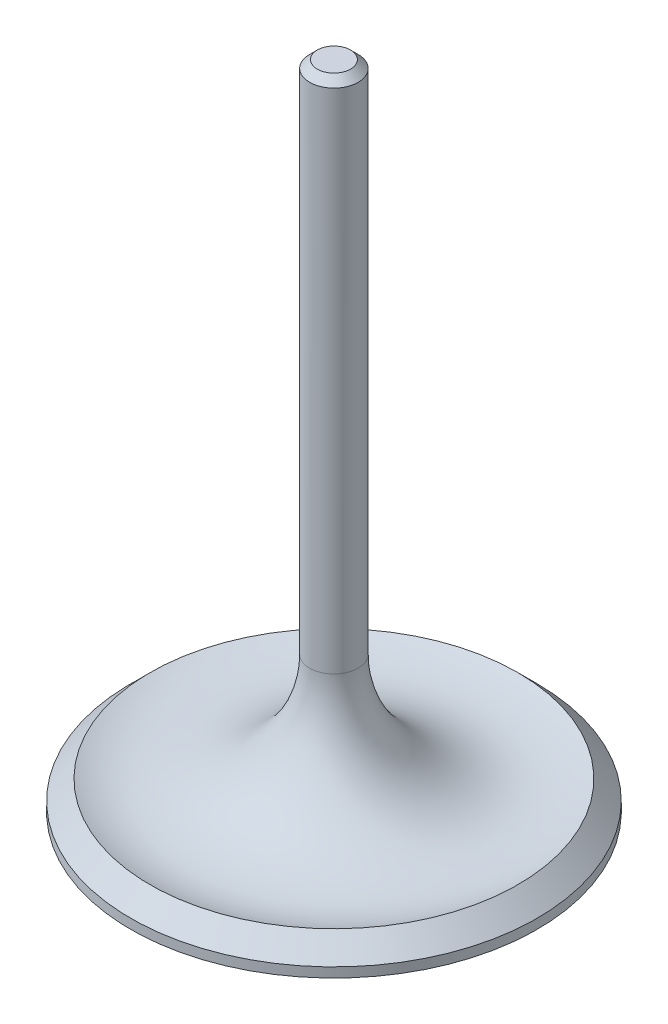
ISO-10303-21;
HEADER;
FILE_DESCRIPTION(('STEP AP214'),'2;1');
FILE_NAME('part.step','',(''),(''),'','','');
FILE_SCHEMA(('AUTOMOTIVE_DESIGN { 1 0 10303 214 1 1 1 1 }'));
ENDSEC;
DATA;
#1=APPLICATION_CONTEXT('core data for automotive mechanical design processes');
#2=APPLICATION_PROTOCOL_DEFINITION('international standard','automotive_design',2000,#1);
#3=PRODUCT_CONTEXT('',#1,'mechanical');
#4=PRODUCT('Part','Part','',(#3));
#5=PRODUCT_RELATED_PRODUCT_CATEGORY('part','',(#4));
#6=PRODUCT_DEFINITION_FORMATION('','',#4);
#7=PRODUCT_DEFINITION_CONTEXT('part definition',#1,'design');
#8=PRODUCT_DEFINITION('design','',#6,#7);
#9=PRODUCT_DEFINITION_SHAPE('','',#8);
#10=(LENGTH_UNIT() NAMED_UNIT(*) SI_UNIT(.MILLI.,.METRE.));
#11=(NAMED_UNIT(*) PLANE_ANGLE_UNIT() SI_UNIT($,.RADIAN.));
#12=(NAMED_UNIT(*) SI_UNIT($,.STERADIAN.) SOLID_ANGLE_UNIT());
#13=UNCERTAINTY_MEASURE_WITH_UNIT(LENGTH_MEASURE(1.E-05),#10,'distance_accuracy_value','');
#14=(GEOMETRIC_REPRESENTATION_CONTEXT(3) GLOBAL_UNCERTAINTY_ASSIGNED_CONTEXT((#13)) GLOBAL_UNIT_ASSIGNED_CONTEXT((#10,
#11,#12)) REPRESENTATION_CONTEXT('',''));
#15=CARTESIAN_POINT('',(0.,0.,0.));
#16=DIRECTION('',(0.,0.,1.));
#17=DIRECTION('',(1.,0.,0.));
#18=AXIS2_PLACEMENT_3D('',#15,#16,#17);
#19=CARTESIAN_POINT('',(26.67,0.,0.));
#20=DIRECTION('',(0.,-1.,0.));
#21=DIRECTION('',(0.,0.,-1.));
#22=AXIS2_PLACEMENT_3D('',#19,#20,#21);
#23=PLANE('',#22);
#24=CARTESIAN_POINT('',(0.,0.,0.));
#25=DIRECTION('',(0.,-1.,0.));
#26=DIRECTION('',(0.,0.,-1.));
#27=AXIS2_PLACEMENT_3D('',#24,#25,#26);
#28=CIRCLE('',#27,26.67);
#29=CARTESIAN_POINT('',(0.,0.,-26.67));
#30=VERTEX_POINT('',#29);
#31=EDGE_CURVE('E56',#30,#30,#28,.T.);
#32=ORIENTED_EDGE('',*,*,#31,.T.);
#33=EDGE_LOOP('',(#32));
#34=FACE_BOUND('',#33,.T.);
#35=ADVANCED_FACE('F42',(#34),#23,.T.);
#36=CARTESIAN_POINT('',(0.,0.,0.));
#37=DIRECTION('',(0.,-1.,0.));
#38=DIRECTION('',(0.,0.,-1.));
#39=AXIS2_PLACEMENT_3D('',#36,#37,#38);
#40=CYLINDRICAL_SURFACE('',#39,26.67);
#41=CARTESIAN_POINT('',(0.,1.27,0.));
#42=DIRECTION('',(0.,-1.,0.));
#43=DIRECTION('',(0.,0.,-1.));
#44=AXIS2_PLACEMENT_3D('',#41,#42,#43);
#45=CIRCLE('',#44,26.67);
#46=CARTESIAN_POINT('',(0.,1.27,-26.67));
#47=VERTEX_POINT('',#46);
#48=EDGE_CURVE('E61',#47,#47,#45,.T.);
#49=ORIENTED_EDGE('',*,*,#48,.T.);
#50=EDGE_LOOP('',(#49));
#51=FACE_BOUND('',#50,.T.);
#52=ORIENTED_EDGE('',*,*,#31,.F.);
#53=EDGE_LOOP('',(#52));
#54=FACE_BOUND('',#53,.T.);
#55=ADVANCED_FACE('F92',(#51,#54),#40,.T.);
#56=CARTESIAN_POINT('',(0.,1.27,0.));
#57=DIRECTION('',(0.,-1.,0.));
#58=DIRECTION('',(0.,0.,-1.));
#59=AXIS2_PLACEMENT_3D('',#56,#57,#58);
#60=CONICAL_SURFACE('',#59,26.67,0.785398163397454);
#61=CARTESIAN_POINT('',(0.,3.81,0.));
#62=DIRECTION('',(0.,-1.,0.));
#63=DIRECTION('',(0.,0.,-1.));
#64=AXIS2_PLACEMENT_3D('',#61,#62,#63);
#65=CIRCLE('',#64,24.13);
#66=CARTESIAN_POINT('',(0.,3.81,-24.13));
#67=VERTEX_POINT('',#66);
#68=EDGE_CURVE('E67',#67,#67,#65,.T.);
#69=ORIENTED_EDGE('',*,*,#68,.T.);
#70=EDGE_LOOP('',(#69));
#71=FACE_BOUND('',#70,.T.);
#72=ORIENTED_EDGE('',*,*,#48,.F.);
#73=EDGE_LOOP('',(#72));
#74=FACE_BOUND('',#73,.T.);
#75=ADVANCED_FACE('F89',(#71,#74),#60,.T.);
#76=CARTESIAN_POINT('',(0.,17.9546986535592,0.));
#77=DIRECTION('',(0.,-1.,0.));
#78=DIRECTION('',(0.,0.,-1.));
#79=AXIS2_PLACEMENT_3D('',#76,#77,#78);
#80=TOROIDAL_SURFACE('',#79,18.43,15.25);
#81=CARTESIAN_POINT('',(0.,17.9546986535592,0.));
#82=DIRECTION('',(0.,-1.,0.));
#83=DIRECTION('',(0.,0.,-1.));
#84=AXIS2_PLACEMENT_3D('',#81,#82,#83);
#85=CIRCLE('',#84,3.18000000000001);
#86=CARTESIAN_POINT('',(0.,17.9546986535592,-3.18000000000001));
#87=VERTEX_POINT('',#86);
#88=EDGE_CURVE('E71',#87,#87,#85,.T.);
#89=ORIENTED_EDGE('',*,*,#88,.T.);
#90=EDGE_LOOP('',(#89));
#91=FACE_BOUND('',#90,.T.);
#92=ORIENTED_EDGE('',*,*,#68,.F.);
#93=EDGE_LOOP('',(#92));
#94=FACE_BOUND('',#93,.T.);
#95=ADVANCED_FACE('F76',(#91,#94),#80,.F.);
#96=CARTESIAN_POINT('',(0.,0.,0.));
#97=DIRECTION('',(0.,-1.,0.));
#98=DIRECTION('',(0.,0.,-1.));
#99=AXIS2_PLACEMENT_3D('',#96,#97,#98);
#100=CYLINDRICAL_SURFACE('',#99,3.18000000000001);
#101=CARTESIAN_POINT('',(0.,84.55,0.));
#102=DIRECTION('',(0.,1.,0.));
#103=DIRECTION('',(0.,0.,1.));
#104=AXIS2_PLACEMENT_3D('',#101,#102,#103);
#105=CIRCLE('',#104,3.18000000000001);
#106=CARTESIAN_POINT('',(0.,84.55,3.18000000000001));
#107=VERTEX_POINT('',#106);
#108=EDGE_CURVE('E51',#107,#107,#105,.F.);
#109=ORIENTED_EDGE('',*,*,#108,.T.);
#110=EDGE_LOOP('',(#109));
#111=FACE_BOUND('',#110,.T.);
#112=ORIENTED_EDGE('',*,*,#88,.F.);
#113=EDGE_LOOP('',(#112));
#114=FACE_BOUND('',#113,.T.);
#115=ADVANCED_FACE('F79',(#111,#114),#100,.T.);
#116=CARTESIAN_POINT('',(0.,85.55,0.));
#117=DIRECTION('',(0.,1.,0.));
#118=DIRECTION('',(0.,0.,1.));
#119=AXIS2_PLACEMENT_3D('',#116,#117,#118);
#120=PLANE('',#119);
#121=CARTESIAN_POINT('',(0.,85.55,0.));
#122=DIRECTION('',(0.,1.,0.));
#123=DIRECTION('',(0.,0.,1.));
#124=AXIS2_PLACEMENT_3D('',#121,#122,#123);
#125=CIRCLE('',#124,2.17999999999997);
#126=CARTESIAN_POINT('',(0.,85.55,2.17999999999997));
#127=VERTEX_POINT('',#126);
#128=EDGE_CURVE('E10',#127,#127,#125,.T.);
#129=ORIENTED_EDGE('',*,*,#128,.T.);
#130=EDGE_LOOP('',(#129));
#131=FACE_BOUND('',#130,.T.);
#132=ADVANCED_FACE('F81',(#131),#120,.T.);
#133=CARTESIAN_POINT('',(0.,84.55,0.));
#134=DIRECTION('',(0.,-1.,0.));
#135=DIRECTION('',(0.,0.,-1.));
#136=AXIS2_PLACEMENT_3D('',#133,#134,#135);
#137=CONICAL_SURFACE('',#136,3.18000000000001,0.785398163397443);
#138=ORIENTED_EDGE('',*,*,#128,.F.);
#139=EDGE_LOOP('',(#138));
#140=FACE_BOUND('',#139,.T.);
#141=ORIENTED_EDGE('',*,*,#108,.F.);
#142=EDGE_LOOP('',(#141));
#143=FACE_BOUND('',#142,.T.);
#144=ADVANCED_FACE('F45',(#140,#143),#137,.T.);
#145=CLOSED_SHELL('',(#35,#55,#75,#95,#115,#132,#144));
#146=MANIFOLD_SOLID_BREP('B2',#145);
#147=ADVANCED_BREP_SHAPE_REPRESENTATION('',(#18,#146),#14);
#148=SHAPE_DEFINITION_REPRESENTATION(#9,#147);
ENDSEC;
END-ISO-10303-21;
